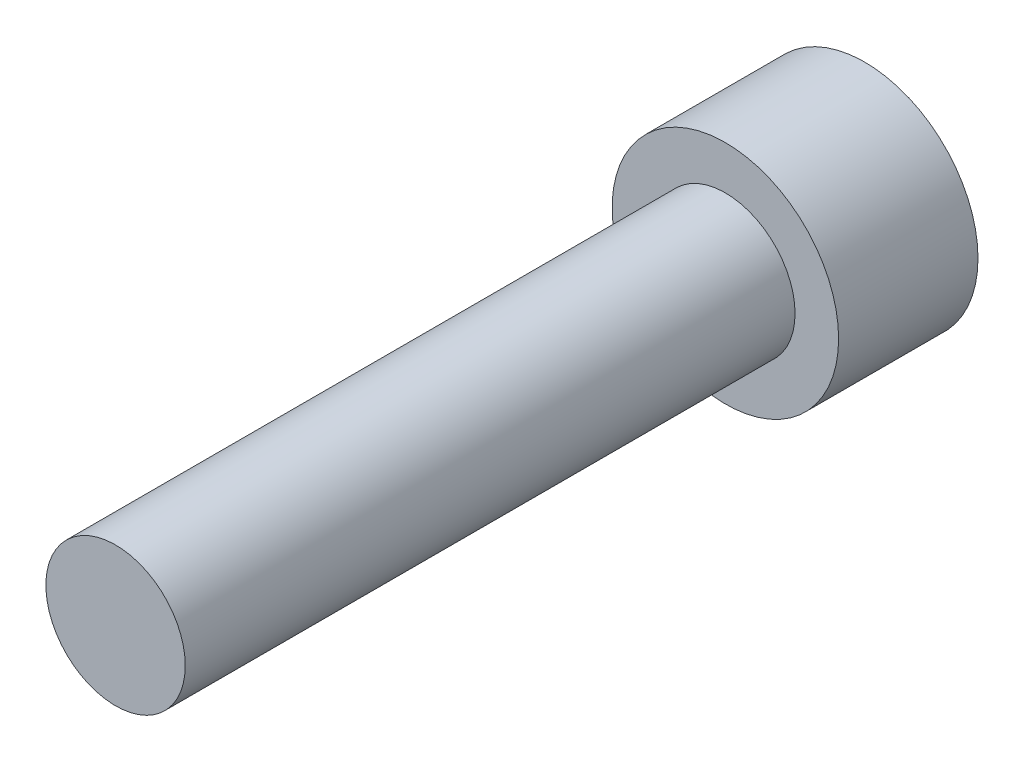
ISO-10303-21;
HEADER;
FILE_DESCRIPTION(('STEP AP214'),'2;1');
FILE_NAME('part.step','',(''),(''),'','','');
FILE_SCHEMA(('AUTOMOTIVE_DESIGN { 1 0 10303 214 1 1 1 1 }'));
ENDSEC;
DATA;
#1=APPLICATION_CONTEXT('core data for automotive mechanical design processes');
#2=APPLICATION_PROTOCOL_DEFINITION('international standard','automotive_design',2000,#1);
#3=PRODUCT_CONTEXT('',#1,'mechanical');
#4=PRODUCT('Part','Part','',(#3));
#5=PRODUCT_RELATED_PRODUCT_CATEGORY('part','',(#4));
#6=PRODUCT_DEFINITION_FORMATION('','',#4);
#7=PRODUCT_DEFINITION_CONTEXT('part definition',#1,'design');
#8=PRODUCT_DEFINITION('design','',#6,#7);
#9=PRODUCT_DEFINITION_SHAPE('','',#8);
#10=(LENGTH_UNIT() NAMED_UNIT(*) SI_UNIT(.MILLI.,.METRE.));
#11=(NAMED_UNIT(*) PLANE_ANGLE_UNIT() SI_UNIT($,.RADIAN.));
#12=(NAMED_UNIT(*) SI_UNIT($,.STERADIAN.) SOLID_ANGLE_UNIT());
#13=UNCERTAINTY_MEASURE_WITH_UNIT(LENGTH_MEASURE(1.E-05),#10,'distance_accuracy_value','');
#14=(GEOMETRIC_REPRESENTATION_CONTEXT(3) GLOBAL_UNCERTAINTY_ASSIGNED_CONTEXT((#13)) GLOBAL_UNIT_ASSIGNED_CONTEXT((#10,
#11,#12)) REPRESENTATION_CONTEXT('',''));
#15=CARTESIAN_POINT('',(0.,0.,0.));
#16=DIRECTION('',(0.,0.,1.));
#17=DIRECTION('',(1.,0.,0.));
#18=AXIS2_PLACEMENT_3D('',#15,#16,#17);
#19=CARTESIAN_POINT('',(-10.1588709229316,10.2421403567261,8.));
#20=DIRECTION('',(0.,0.,-1.));
#21=DIRECTION('',(-1.,0.,0.));
#22=AXIS2_PLACEMENT_3D('',#19,#20,#21);
#23=CYLINDRICAL_SURFACE('',#22,6.5);
#24=CARTESIAN_POINT('',(-10.1588709229316,10.2421403567261,8.));
#25=DIRECTION('',(0.,0.,1.));
#26=DIRECTION('',(1.,0.,0.));
#27=AXIS2_PLACEMENT_3D('',#24,#25,#26);
#28=CIRCLE('',#27,6.5);
#29=CARTESIAN_POINT('',(-3.65887092293158,10.2421403567261,8.));
#30=VERTEX_POINT('',#29);
#31=EDGE_CURVE('E43',#30,#30,#28,.T.);
#32=ORIENTED_EDGE('',*,*,#31,.F.);
#33=EDGE_LOOP('',(#32));
#34=FACE_BOUND('',#33,.T.);
#35=CARTESIAN_POINT('',(-10.1588709229316,10.2421403567261,0.));
#36=DIRECTION('',(0.,0.,1.));
#37=DIRECTION('',(1.,0.,0.));
#38=AXIS2_PLACEMENT_3D('',#35,#36,#37);
#39=CIRCLE('',#38,6.5);
#40=CARTESIAN_POINT('',(-3.65887092293158,10.2421403567261,0.));
#41=VERTEX_POINT('',#40);
#42=EDGE_CURVE('E39',#41,#41,#39,.T.);
#43=ORIENTED_EDGE('',*,*,#42,.T.);
#44=EDGE_LOOP('',(#43));
#45=FACE_BOUND('',#44,.T.);
#46=ADVANCED_FACE('F36',(#34,#45),#23,.T.);
#47=CARTESIAN_POINT('',(-10.1588709229316,10.2421403567261,8.));
#48=DIRECTION('',(0.,0.,1.));
#49=DIRECTION('',(1.,0.,0.));
#50=AXIS2_PLACEMENT_3D('',#47,#48,#49);
#51=PLANE('',#50);
#52=CARTESIAN_POINT('',(-10.1588709229316,10.2421403567261,8.));
#53=DIRECTION('',(0.,0.,1.));
#54=DIRECTION('',(1.,0.,0.));
#55=AXIS2_PLACEMENT_3D('',#52,#53,#54);
#56=CIRCLE('',#55,4.);
#57=CARTESIAN_POINT('',(-6.15887092293158,10.2421403567261,8.));
#58=VERTEX_POINT('',#57);
#59=EDGE_CURVE('E10',#58,#58,#56,.T.);
#60=ORIENTED_EDGE('',*,*,#59,.F.);
#61=EDGE_LOOP('',(#60));
#62=FACE_BOUND('',#61,.T.);
#63=ORIENTED_EDGE('',*,*,#31,.T.);
#64=EDGE_LOOP('',(#63));
#65=FACE_BOUND('',#64,.T.);
#66=ADVANCED_FACE('F60',(#62,#65),#51,.T.);
#67=CARTESIAN_POINT('',(-10.1588709229316,10.2421403567261,0.));
#68=DIRECTION('',(0.,0.,1.));
#69=DIRECTION('',(1.,0.,0.));
#70=AXIS2_PLACEMENT_3D('',#67,#68,#69);
#71=PLANE('',#70);
#72=ORIENTED_EDGE('',*,*,#42,.F.);
#73=EDGE_LOOP('',(#72));
#74=FACE_BOUND('',#73,.T.);
#75=ADVANCED_FACE('F57',(#74),#71,.F.);
#76=CARTESIAN_POINT('',(-10.1588709229316,10.2421403567261,43.));
#77=DIRECTION('',(0.,0.,-1.));
#78=DIRECTION('',(-1.,0.,0.));
#79=AXIS2_PLACEMENT_3D('',#76,#77,#78);
#80=CYLINDRICAL_SURFACE('',#79,4.);
#81=CARTESIAN_POINT('',(-10.1588709229316,10.2421403567261,43.));
#82=DIRECTION('',(0.,0.,1.));
#83=DIRECTION('',(1.,0.,0.));
#84=AXIS2_PLACEMENT_3D('',#81,#82,#83);
#85=CIRCLE('',#84,4.);
#86=CARTESIAN_POINT('',(-6.15887092293158,10.2421403567261,43.));
#87=VERTEX_POINT('',#86);
#88=EDGE_CURVE('E49',#87,#87,#85,.T.);
#89=ORIENTED_EDGE('',*,*,#88,.F.);
#90=EDGE_LOOP('',(#89));
#91=FACE_BOUND('',#90,.T.);
#92=ORIENTED_EDGE('',*,*,#59,.T.);
#93=EDGE_LOOP('',(#92));
#94=FACE_BOUND('',#93,.T.);
#95=ADVANCED_FACE('F59',(#91,#94),#80,.T.);
#96=CARTESIAN_POINT('',(-10.1588709229316,10.2421403567261,43.));
#97=DIRECTION('',(0.,0.,1.));
#98=DIRECTION('',(1.,0.,0.));
#99=AXIS2_PLACEMENT_3D('',#96,#97,#98);
#100=PLANE('',#99);
#101=ORIENTED_EDGE('',*,*,#88,.T.);
#102=EDGE_LOOP('',(#101));
#103=FACE_BOUND('',#102,.T.);
#104=ADVANCED_FACE('F65',(#103),#100,.T.);
#105=CLOSED_SHELL('',(#46,#66,#75,#95,#104));
#106=MANIFOLD_SOLID_BREP('B2',#105);
#107=ADVANCED_BREP_SHAPE_REPRESENTATION('',(#18,#106),#14);
#108=SHAPE_DEFINITION_REPRESENTATION(#9,#107);
ENDSEC;
END-ISO-10303-21;
